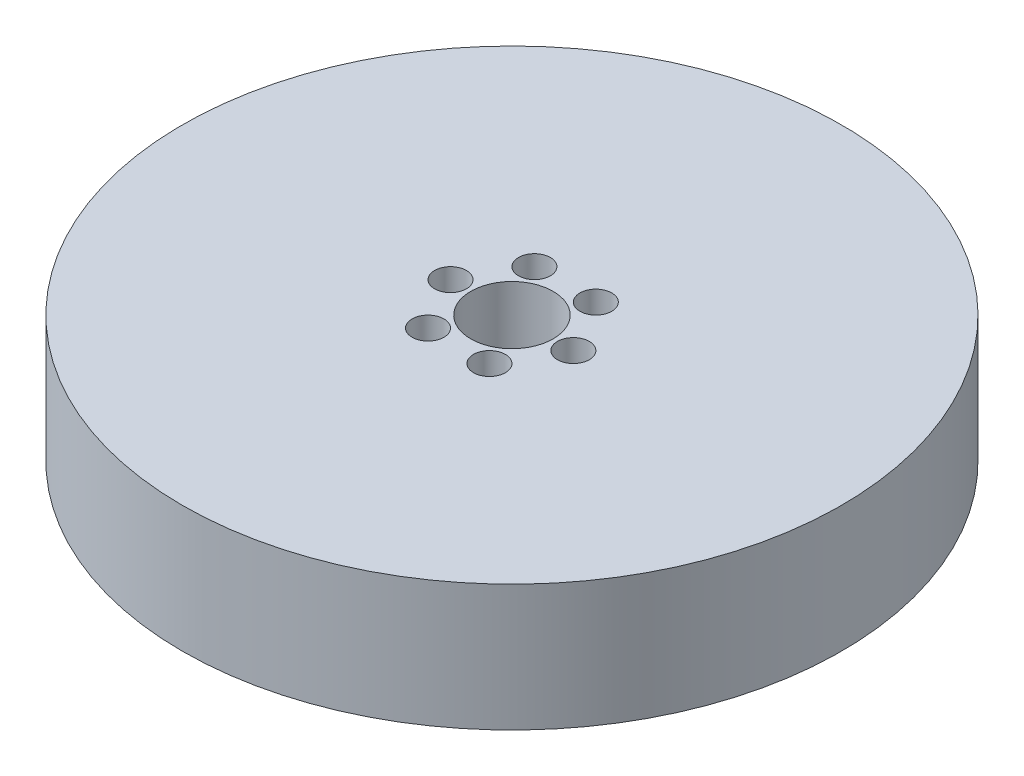
ISO-10303-21;
HEADER;
FILE_DESCRIPTION(('STEP AP214'),'2;1');
FILE_NAME('part.step','',(''),(''),'','','');
FILE_SCHEMA(('AUTOMOTIVE_DESIGN { 1 0 10303 214 1 1 1 1 }'));
ENDSEC;
DATA;
#1=APPLICATION_CONTEXT('core data for automotive mechanical design processes');
#2=APPLICATION_PROTOCOL_DEFINITION('international standard','automotive_design',2000,#1);
#3=PRODUCT_CONTEXT('',#1,'mechanical');
#4=PRODUCT('Part','Part','',(#3));
#5=PRODUCT_RELATED_PRODUCT_CATEGORY('part','',(#4));
#6=PRODUCT_DEFINITION_FORMATION('','',#4);
#7=PRODUCT_DEFINITION_CONTEXT('part definition',#1,'design');
#8=PRODUCT_DEFINITION('design','',#6,#7);
#9=PRODUCT_DEFINITION_SHAPE('','',#8);
#10=(LENGTH_UNIT() NAMED_UNIT(*) SI_UNIT(.MILLI.,.METRE.));
#11=(NAMED_UNIT(*) PLANE_ANGLE_UNIT() SI_UNIT($,.RADIAN.));
#12=(NAMED_UNIT(*) SI_UNIT($,.STERADIAN.) SOLID_ANGLE_UNIT());
#13=UNCERTAINTY_MEASURE_WITH_UNIT(LENGTH_MEASURE(1.E-05),#10,'distance_accuracy_value','');
#14=(GEOMETRIC_REPRESENTATION_CONTEXT(3) GLOBAL_UNCERTAINTY_ASSIGNED_CONTEXT((#13)) GLOBAL_UNIT_ASSIGNED_CONTEXT((#10,
#11,#12)) REPRESENTATION_CONTEXT('',''));
#15=CARTESIAN_POINT('',(0.,0.,0.));
#16=DIRECTION('',(0.,0.,1.));
#17=DIRECTION('',(1.,0.,0.));
#18=AXIS2_PLACEMENT_3D('',#15,#16,#17);
#19=CARTESIAN_POINT('',(0.,23.,0.));
#20=DIRECTION('',(0.,-1.,0.));
#21=DIRECTION('',(0.,0.,-1.));
#22=AXIS2_PLACEMENT_3D('',#19,#20,#21);
#23=CYLINDRICAL_SURFACE('',#22,60.);
#24=CARTESIAN_POINT('',(0.,23.,0.));
#25=DIRECTION('',(0.,1.,0.));
#26=DIRECTION('',(0.,0.,1.));
#27=AXIS2_PLACEMENT_3D('',#24,#25,#26);
#28=CIRCLE('',#27,60.);
#29=CARTESIAN_POINT('',(0.,23.,60.));
#30=VERTEX_POINT('',#29);
#31=EDGE_CURVE('E10',#30,#30,#28,.T.);
#32=ORIENTED_EDGE('',*,*,#31,.F.);
#33=EDGE_LOOP('',(#32));
#34=FACE_BOUND('',#33,.T.);
#35=CARTESIAN_POINT('',(0.,0.,0.));
#36=DIRECTION('',(0.,1.,0.));
#37=DIRECTION('',(0.,0.,1.));
#38=AXIS2_PLACEMENT_3D('',#35,#36,#37);
#39=CIRCLE('',#38,60.);
#40=CARTESIAN_POINT('',(0.,0.,60.));
#41=VERTEX_POINT('',#40);
#42=EDGE_CURVE('E37',#41,#41,#39,.T.);
#43=ORIENTED_EDGE('',*,*,#42,.T.);
#44=EDGE_LOOP('',(#43));
#45=FACE_BOUND('',#44,.T.);
#46=ADVANCED_FACE('F40',(#34,#45),#23,.T.);
#47=CARTESIAN_POINT('',(0.,23.,0.));
#48=DIRECTION('',(0.,1.,0.));
#49=DIRECTION('',(0.,0.,1.));
#50=AXIS2_PLACEMENT_3D('',#47,#48,#49);
#51=PLANE('',#50);
#52=CARTESIAN_POINT('',(-5.59146420317601,23.,-9.68470008860321));
#53=DIRECTION('',(0.,1.,0.));
#54=DIRECTION('',(-0.866025403784433,0.,0.50000000000001));
#55=AXIS2_PLACEMENT_3D('',#52,#53,#54);
#56=CIRCLE('',#55,2.89900534983719);
#57=CARTESIAN_POINT('',(-8.10207648184199,23.,-8.23519741368459));
#58=VERTEX_POINT('',#57);
#59=EDGE_CURVE('E70',#58,#58,#56,.T.);
#60=ORIENTED_EDGE('',*,*,#59,.F.);
#61=EDGE_LOOP('',(#60));
#62=FACE_BOUND('',#61,.T.);
#63=CARTESIAN_POINT('',(5.5914642031758,23.,-9.68470008860333));
#64=DIRECTION('',(0.,1.,0.));
#65=DIRECTION('',(-0.866025403784443,0.,-0.499999999999992));
#66=AXIS2_PLACEMENT_3D('',#63,#64,#65);
#67=CIRCLE('',#66,2.89900534983719);
#68=CARTESIAN_POINT('',(3.08085192450979,23.,-11.1342027635219));
#69=VERTEX_POINT('',#68);
#70=EDGE_CURVE('E71',#69,#69,#67,.T.);
#71=ORIENTED_EDGE('',*,*,#70,.F.);
#72=EDGE_LOOP('',(#71));
#73=FACE_BOUND('',#72,.T.);
#74=CARTESIAN_POINT('',(11.1829284063518,23.,0.));
#75=DIRECTION('',(0.,1.,0.));
#76=DIRECTION('',(0.,0.,-1.));
#77=AXIS2_PLACEMENT_3D('',#74,#75,#76);
#78=CIRCLE('',#77,2.89900534983719);
#79=CARTESIAN_POINT('',(11.1829284063518,23.,-2.89900534983719));
#80=VERTEX_POINT('',#79);
#81=EDGE_CURVE('E78',#80,#80,#78,.T.);
#82=ORIENTED_EDGE('',*,*,#81,.F.);
#83=EDGE_LOOP('',(#82));
#84=FACE_BOUND('',#83,.T.);
#85=CARTESIAN_POINT('',(5.59146420317594,23.,9.68470008860325));
#86=DIRECTION('',(0.,1.,0.));
#87=DIRECTION('',(0.866025403784436,0.,-0.500000000000004));
#88=AXIS2_PLACEMENT_3D('',#85,#86,#87);
#89=CIRCLE('',#88,2.89900534983719);
#90=CARTESIAN_POINT('',(8.10207648184193,23.,8.23519741368465));
#91=VERTEX_POINT('',#90);
#92=EDGE_CURVE('E84',#91,#91,#89,.T.);
#93=ORIENTED_EDGE('',*,*,#92,.F.);
#94=EDGE_LOOP('',(#93));
#95=FACE_BOUND('',#94,.T.);
#96=CARTESIAN_POINT('',(-5.59146420317587,23.,9.68470008860329));
#97=DIRECTION('',(0.,1.,0.));
#98=DIRECTION('',(0.86602540378444,0.,0.499999999999998));
#99=AXIS2_PLACEMENT_3D('',#96,#97,#98);
#100=CIRCLE('',#99,2.89900534983719);
#101=CARTESIAN_POINT('',(-3.08085192450987,23.,11.1342027635219));
#102=VERTEX_POINT('',#101);
#103=EDGE_CURVE('E61',#102,#102,#100,.T.);
#104=ORIENTED_EDGE('',*,*,#103,.F.);
#105=EDGE_LOOP('',(#104));
#106=FACE_BOUND('',#105,.T.);
#107=CARTESIAN_POINT('',(-11.1829284063518,23.,0.));
#108=DIRECTION('',(0.,1.,0.));
#109=DIRECTION('',(0.,0.,1.));
#110=AXIS2_PLACEMENT_3D('',#107,#108,#109);
#111=CIRCLE('',#110,2.89900534983719);
#112=CARTESIAN_POINT('',(-11.1829284063518,23.,2.89900534983719));
#113=VERTEX_POINT('',#112);
#114=EDGE_CURVE('E54',#113,#113,#111,.T.);
#115=ORIENTED_EDGE('',*,*,#114,.F.);
#116=EDGE_LOOP('',(#115));
#117=FACE_BOUND('',#116,.T.);
#118=CARTESIAN_POINT('',(0.,23.,0.));
#119=DIRECTION('',(0.,1.,0.));
#120=DIRECTION('',(0.,0.,1.));
#121=AXIS2_PLACEMENT_3D('',#118,#119,#120);
#122=CIRCLE('',#121,7.5);
#123=CARTESIAN_POINT('',(0.,23.,7.5));
#124=VERTEX_POINT('',#123);
#125=EDGE_CURVE('E50',#124,#124,#122,.T.);
#126=ORIENTED_EDGE('',*,*,#125,.F.);
#127=EDGE_LOOP('',(#126));
#128=FACE_BOUND('',#127,.T.);
#129=ORIENTED_EDGE('',*,*,#31,.T.);
#130=EDGE_LOOP('',(#129));
#131=FACE_BOUND('',#130,.T.);
#132=ADVANCED_FACE('F99',(#62,#73,#84,#95,#106,#117,#128,#131),#51,.T.);
#133=CARTESIAN_POINT('',(0.,0.,0.));
#134=DIRECTION('',(0.,1.,0.));
#135=DIRECTION('',(0.,0.,1.));
#136=AXIS2_PLACEMENT_3D('',#133,#134,#135);
#137=PLANE('',#136);
#138=CARTESIAN_POINT('',(0.,0.,0.));
#139=DIRECTION('',(0.,1.,0.));
#140=DIRECTION('',(0.,0.,1.));
#141=AXIS2_PLACEMENT_3D('',#138,#139,#140);
#142=CIRCLE('',#141,7.5);
#143=CARTESIAN_POINT('',(0.,0.,7.5));
#144=VERTEX_POINT('',#143);
#145=EDGE_CURVE('E47',#144,#144,#142,.T.);
#146=ORIENTED_EDGE('',*,*,#145,.T.);
#147=EDGE_LOOP('',(#146));
#148=FACE_BOUND('',#147,.T.);
#149=ORIENTED_EDGE('',*,*,#42,.F.);
#150=EDGE_LOOP('',(#149));
#151=FACE_BOUND('',#150,.T.);
#152=ADVANCED_FACE('F103',(#148,#151),#137,.F.);
#153=CARTESIAN_POINT('',(0.,23.,0.));
#154=DIRECTION('',(0.,-1.,0.));
#155=DIRECTION('',(0.,0.,-1.));
#156=AXIS2_PLACEMENT_3D('',#153,#154,#155);
#157=CYLINDRICAL_SURFACE('',#156,7.5);
#158=ORIENTED_EDGE('',*,*,#125,.T.);
#159=EDGE_LOOP('',(#158));
#160=FACE_BOUND('',#159,.T.);
#161=ORIENTED_EDGE('',*,*,#145,.F.);
#162=EDGE_LOOP('',(#161));
#163=FACE_BOUND('',#162,.T.);
#164=ADVANCED_FACE('F115',(#160,#163),#157,.F.);
#165=CARTESIAN_POINT('',(-11.1829284063518,5.40682633427809,0.));
#166=DIRECTION('',(0.,1.,0.));
#167=DIRECTION('',(0.,0.,1.));
#168=AXIS2_PLACEMENT_3D('',#165,#166,#167);
#169=CYLINDRICAL_SURFACE('',#168,2.89900534983719);
#170=CARTESIAN_POINT('',(-11.1829284063518,5.40682633427809,0.));
#171=DIRECTION('',(0.,1.,0.));
#172=DIRECTION('',(0.,0.,1.));
#173=AXIS2_PLACEMENT_3D('',#170,#171,#172);
#174=CIRCLE('',#173,2.89900534983719);
#175=CARTESIAN_POINT('',(-11.1829284063518,5.40682633427809,2.89900534983719));
#176=VERTEX_POINT('',#175);
#177=EDGE_CURVE('E55',#176,#176,#174,.T.);
#178=ORIENTED_EDGE('',*,*,#177,.F.);
#179=EDGE_LOOP('',(#178));
#180=FACE_BOUND('',#179,.T.);
#181=ORIENTED_EDGE('',*,*,#114,.T.);
#182=EDGE_LOOP('',(#181));
#183=FACE_BOUND('',#182,.T.);
#184=ADVANCED_FACE('F113',(#180,#183),#169,.F.);
#185=CARTESIAN_POINT('',(-11.1829284063518,5.40682633427809,0.));
#186=DIRECTION('',(0.,1.,0.));
#187=DIRECTION('',(0.,0.,1.));
#188=AXIS2_PLACEMENT_3D('',#185,#186,#187);
#189=PLANE('',#188);
#190=ORIENTED_EDGE('',*,*,#177,.T.);
#191=EDGE_LOOP('',(#190));
#192=FACE_BOUND('',#191,.T.);
#193=ADVANCED_FACE('F144',(#192),#189,.T.);
#194=CARTESIAN_POINT('',(-5.59146420317587,5.40682633427809,9.68470008860329));
#195=DIRECTION('',(0.,1.,0.));
#196=DIRECTION('',(0.,0.,1.));
#197=AXIS2_PLACEMENT_3D('',#194,#195,#196);
#198=CYLINDRICAL_SURFACE('',#197,2.89900534983719);
#199=CARTESIAN_POINT('',(-5.59146420317587,5.40682633427809,9.68470008860329));
#200=DIRECTION('',(0.,1.,0.));
#201=DIRECTION('',(0.86602540378444,0.,0.499999999999998));
#202=AXIS2_PLACEMENT_3D('',#199,#200,#201);
#203=CIRCLE('',#202,2.89900534983719);
#204=CARTESIAN_POINT('',(-3.08085192450987,5.40682633427809,11.1342027635219));
#205=VERTEX_POINT('',#204);
#206=EDGE_CURVE('E59',#205,#205,#203,.T.);
#207=ORIENTED_EDGE('',*,*,#206,.F.);
#208=EDGE_LOOP('',(#207));
#209=FACE_BOUND('',#208,.T.);
#210=ORIENTED_EDGE('',*,*,#103,.T.);
#211=EDGE_LOOP('',(#210));
#212=FACE_BOUND('',#211,.T.);
#213=ADVANCED_FACE('F153',(#209,#212),#198,.F.);
#214=CARTESIAN_POINT('',(-5.59146420317587,5.40682633427809,9.68470008860329));
#215=DIRECTION('',(0.,1.,0.));
#216=DIRECTION('',(0.86602540378444,0.,0.499999999999998));
#217=AXIS2_PLACEMENT_3D('',#214,#215,#216);
#218=PLANE('',#217);
#219=ORIENTED_EDGE('',*,*,#206,.T.);
#220=EDGE_LOOP('',(#219));
#221=FACE_BOUND('',#220,.T.);
#222=ADVANCED_FACE('F96',(#221),#218,.T.);
#223=CARTESIAN_POINT('',(5.59146420317594,5.40682633427809,9.68470008860325));
#224=DIRECTION('',(0.,1.,0.));
#225=DIRECTION('',(0.,0.,1.));
#226=AXIS2_PLACEMENT_3D('',#223,#224,#225);
#227=CYLINDRICAL_SURFACE('',#226,2.89900534983719);
#228=CARTESIAN_POINT('',(5.59146420317594,5.40682633427809,9.68470008860325));
#229=DIRECTION('',(0.,1.,0.));
#230=DIRECTION('',(0.866025403784436,0.,-0.500000000000004));
#231=AXIS2_PLACEMENT_3D('',#228,#229,#230);
#232=CIRCLE('',#231,2.89900534983719);
#233=CARTESIAN_POINT('',(8.10207648184193,5.40682633427809,8.23519741368465));
#234=VERTEX_POINT('',#233);
#235=EDGE_CURVE('E63',#234,#234,#232,.T.);
#236=ORIENTED_EDGE('',*,*,#235,.F.);
#237=EDGE_LOOP('',(#236));
#238=FACE_BOUND('',#237,.T.);
#239=ORIENTED_EDGE('',*,*,#92,.T.);
#240=EDGE_LOOP('',(#239));
#241=FACE_BOUND('',#240,.T.);
#242=ADVANCED_FACE('F91',(#238,#241),#227,.F.);
#243=CARTESIAN_POINT('',(5.59146420317594,5.40682633427809,9.68470008860325));
#244=DIRECTION('',(0.,1.,0.));
#245=DIRECTION('',(0.866025403784436,0.,-0.500000000000004));
#246=AXIS2_PLACEMENT_3D('',#243,#244,#245);
#247=PLANE('',#246);
#248=ORIENTED_EDGE('',*,*,#235,.T.);
#249=EDGE_LOOP('',(#248));
#250=FACE_BOUND('',#249,.T.);
#251=ADVANCED_FACE('F93',(#250),#247,.T.);
#252=CARTESIAN_POINT('',(11.1829284063518,5.40682633427809,0.));
#253=DIRECTION('',(0.,1.,0.));
#254=DIRECTION('',(0.,0.,1.));
#255=AXIS2_PLACEMENT_3D('',#252,#253,#254);
#256=CYLINDRICAL_SURFACE('',#255,2.89900534983719);
#257=CARTESIAN_POINT('',(11.1829284063518,5.40682633427809,0.));
#258=DIRECTION('',(0.,1.,0.));
#259=DIRECTION('',(0.,0.,-1.));
#260=AXIS2_PLACEMENT_3D('',#257,#258,#259);
#261=CIRCLE('',#260,2.89900534983719);
#262=CARTESIAN_POINT('',(11.1829284063518,5.40682633427809,-2.89900534983719));
#263=VERTEX_POINT('',#262);
#264=EDGE_CURVE('E85',#263,#263,#261,.T.);
#265=ORIENTED_EDGE('',*,*,#264,.F.);
#266=EDGE_LOOP('',(#265));
#267=FACE_BOUND('',#266,.T.);
#268=ORIENTED_EDGE('',*,*,#81,.T.);
#269=EDGE_LOOP('',(#268));
#270=FACE_BOUND('',#269,.T.);
#271=ADVANCED_FACE('F187',(#267,#270),#256,.F.);
#272=CARTESIAN_POINT('',(11.1829284063518,5.40682633427809,0.));
#273=DIRECTION('',(0.,1.,0.));
#274=DIRECTION('',(0.,0.,-1.));
#275=AXIS2_PLACEMENT_3D('',#272,#273,#274);
#276=PLANE('',#275);
#277=ORIENTED_EDGE('',*,*,#264,.T.);
#278=EDGE_LOOP('',(#277));
#279=FACE_BOUND('',#278,.T.);
#280=ADVANCED_FACE('F198',(#279),#276,.T.);
#281=CARTESIAN_POINT('',(5.5914642031758,5.40682633427809,-9.68470008860333));
#282=DIRECTION('',(0.,1.,0.));
#283=DIRECTION('',(0.,0.,1.));
#284=AXIS2_PLACEMENT_3D('',#281,#282,#283);
#285=CYLINDRICAL_SURFACE('',#284,2.89900534983719);
#286=CARTESIAN_POINT('',(5.5914642031758,5.40682633427809,-9.68470008860333));
#287=DIRECTION('',(0.,1.,0.));
#288=DIRECTION('',(-0.866025403784443,0.,-0.499999999999992));
#289=AXIS2_PLACEMENT_3D('',#286,#287,#288);
#290=CIRCLE('',#289,2.89900534983719);
#291=CARTESIAN_POINT('',(3.08085192450979,5.40682633427809,-11.1342027635219));
#292=VERTEX_POINT('',#291);
#293=EDGE_CURVE('E76',#292,#292,#290,.T.);
#294=ORIENTED_EDGE('',*,*,#293,.F.);
#295=EDGE_LOOP('',(#294));
#296=FACE_BOUND('',#295,.T.);
#297=ORIENTED_EDGE('',*,*,#70,.T.);
#298=EDGE_LOOP('',(#297));
#299=FACE_BOUND('',#298,.T.);
#300=ADVANCED_FACE('F202',(#296,#299),#285,.F.);
#301=CARTESIAN_POINT('',(5.5914642031758,5.40682633427809,-9.68470008860333));
#302=DIRECTION('',(0.,1.,0.));
#303=DIRECTION('',(-0.866025403784443,0.,-0.499999999999992));
#304=AXIS2_PLACEMENT_3D('',#301,#302,#303);
#305=PLANE('',#304);
#306=ORIENTED_EDGE('',*,*,#293,.T.);
#307=EDGE_LOOP('',(#306));
#308=FACE_BOUND('',#307,.T.);
#309=ADVANCED_FACE('F212',(#308),#305,.T.);
#310=CARTESIAN_POINT('',(-5.59146420317601,5.40682633427809,-9.68470008860321));
#311=DIRECTION('',(0.,1.,0.));
#312=DIRECTION('',(0.,0.,1.));
#313=AXIS2_PLACEMENT_3D('',#310,#311,#312);
#314=CYLINDRICAL_SURFACE('',#313,2.89900534983719);
#315=CARTESIAN_POINT('',(-5.59146420317601,5.40682633427809,-9.68470008860321));
#316=DIRECTION('',(0.,1.,0.));
#317=DIRECTION('',(-0.866025403784433,0.,0.50000000000001));
#318=AXIS2_PLACEMENT_3D('',#315,#316,#317);
#319=CIRCLE('',#318,2.89900534983719);
#320=CARTESIAN_POINT('',(-8.10207648184199,5.40682633427809,-8.23519741368459));
#321=VERTEX_POINT('',#320);
#322=EDGE_CURVE('E69',#321,#321,#319,.T.);
#323=ORIENTED_EDGE('',*,*,#322,.F.);
#324=EDGE_LOOP('',(#323));
#325=FACE_BOUND('',#324,.T.);
#326=ORIENTED_EDGE('',*,*,#59,.T.);
#327=EDGE_LOOP('',(#326));
#328=FACE_BOUND('',#327,.T.);
#329=ADVANCED_FACE('F224',(#325,#328),#314,.F.);
#330=CARTESIAN_POINT('',(-5.59146420317601,5.40682633427809,-9.68470008860321));
#331=DIRECTION('',(0.,1.,0.));
#332=DIRECTION('',(-0.866025403784433,0.,0.50000000000001));
#333=AXIS2_PLACEMENT_3D('',#330,#331,#332);
#334=PLANE('',#333);
#335=ORIENTED_EDGE('',*,*,#322,.T.);
#336=EDGE_LOOP('',(#335));
#337=FACE_BOUND('',#336,.T.);
#338=ADVANCED_FACE('F235',(#337),#334,.T.);
#339=CLOSED_SHELL('',(#46,#132,#152,#164,#184,#193,#213,#222,#242,#251,#271,#280,#300,#309,#329,#338));
#340=MANIFOLD_SOLID_BREP('B2',#339);
#341=ADVANCED_BREP_SHAPE_REPRESENTATION('',(#18,#340),#14);
#342=SHAPE_DEFINITION_REPRESENTATION(#9,#341);
ENDSEC;
END-ISO-10303-21;
